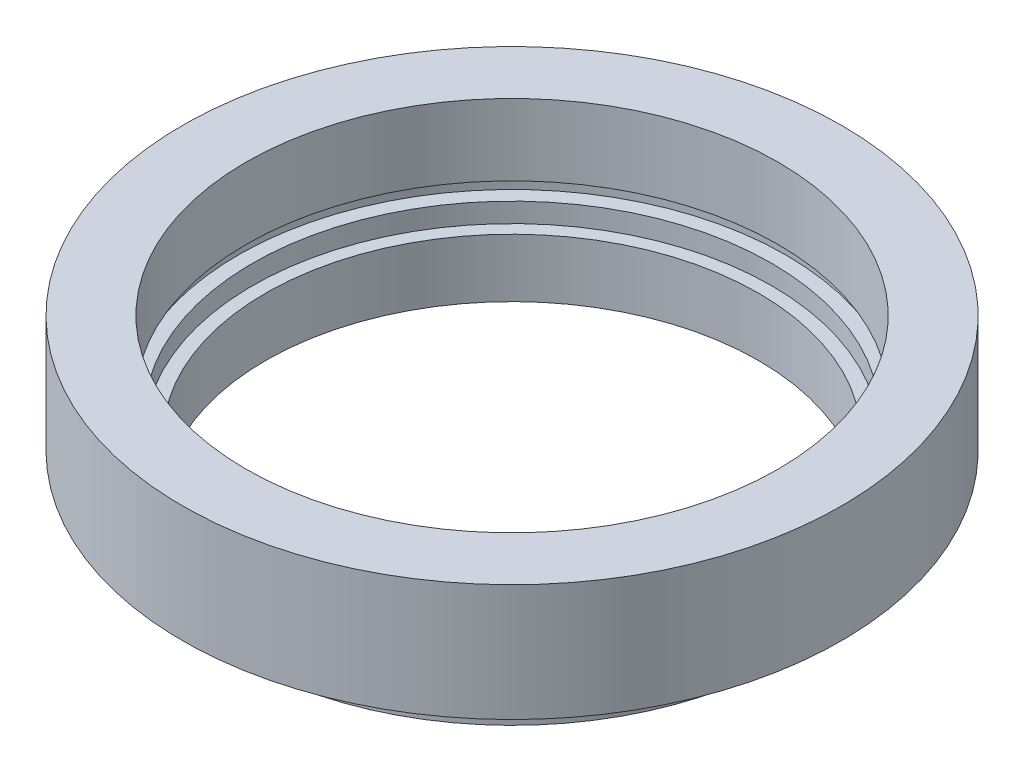
ISO-10303-21;
HEADER;
FILE_DESCRIPTION(('STEP AP214'),'2;1');
FILE_NAME('part.step','',(''),(''),'','','');
FILE_SCHEMA(('AUTOMOTIVE_DESIGN { 1 0 10303 214 1 1 1 1 }'));
ENDSEC;
DATA;
#1=APPLICATION_CONTEXT('core data for automotive mechanical design processes');
#2=APPLICATION_PROTOCOL_DEFINITION('international standard','automotive_design',2000,#1);
#3=PRODUCT_CONTEXT('',#1,'mechanical');
#4=PRODUCT('Part','Part','',(#3));
#5=PRODUCT_RELATED_PRODUCT_CATEGORY('part','',(#4));
#6=PRODUCT_DEFINITION_FORMATION('','',#4);
#7=PRODUCT_DEFINITION_CONTEXT('part definition',#1,'design');
#8=PRODUCT_DEFINITION('design','',#6,#7);
#9=PRODUCT_DEFINITION_SHAPE('','',#8);
#10=(LENGTH_UNIT() NAMED_UNIT(*) SI_UNIT(.MILLI.,.METRE.));
#11=(NAMED_UNIT(*) PLANE_ANGLE_UNIT() SI_UNIT($,.RADIAN.));
#12=(NAMED_UNIT(*) SI_UNIT($,.STERADIAN.) SOLID_ANGLE_UNIT());
#13=UNCERTAINTY_MEASURE_WITH_UNIT(LENGTH_MEASURE(1.E-05),#10,'distance_accuracy_value','');
#14=(GEOMETRIC_REPRESENTATION_CONTEXT(3) GLOBAL_UNCERTAINTY_ASSIGNED_CONTEXT((#13)) GLOBAL_UNIT_ASSIGNED_CONTEXT((#10,
#11,#12)) REPRESENTATION_CONTEXT('',''));
#15=CARTESIAN_POINT('',(0.,0.,0.));
#16=DIRECTION('',(0.,0.,1.));
#17=DIRECTION('',(1.,0.,0.));
#18=AXIS2_PLACEMENT_3D('',#15,#16,#17);
#19=CARTESIAN_POINT('',(0.,0.,0.));
#20=DIRECTION('',(0.,-1.,0.));
#21=DIRECTION('',(0.,0.,-1.));
#22=AXIS2_PLACEMENT_3D('',#19,#20,#21);
#23=CYLINDRICAL_SURFACE('',#22,19.);
#24=CARTESIAN_POINT('',(0.,0.,0.));
#25=DIRECTION('',(0.,-1.,0.));
#26=DIRECTION('',(0.,0.,-1.));
#27=AXIS2_PLACEMENT_3D('',#24,#25,#26);
#28=CIRCLE('',#27,19.);
#29=CARTESIAN_POINT('',(0.,0.,-19.));
#30=VERTEX_POINT('',#29);
#31=EDGE_CURVE('E10',#30,#30,#28,.T.);
#32=ORIENTED_EDGE('',*,*,#31,.T.);
#33=EDGE_LOOP('',(#32));
#34=FACE_BOUND('',#33,.T.);
#35=CARTESIAN_POINT('',(0.,4.5,0.));
#36=DIRECTION('',(0.,-1.,0.));
#37=DIRECTION('',(0.,0.,-1.));
#38=AXIS2_PLACEMENT_3D('',#35,#36,#37);
#39=CIRCLE('',#38,19.);
#40=CARTESIAN_POINT('',(0.,4.5,-19.));
#41=VERTEX_POINT('',#40);
#42=EDGE_CURVE('E95',#41,#41,#39,.T.);
#43=ORIENTED_EDGE('',*,*,#42,.F.);
#44=EDGE_LOOP('',(#43));
#45=FACE_BOUND('',#44,.T.);
#46=ADVANCED_FACE('F36',(#34,#45),#23,.F.);
#47=CARTESIAN_POINT('',(19.,0.,0.));
#48=DIRECTION('',(0.,-1.,0.));
#49=DIRECTION('',(0.,0.,-1.));
#50=AXIS2_PLACEMENT_3D('',#47,#48,#49);
#51=PLANE('',#50);
#52=CARTESIAN_POINT('',(0.,0.,0.));
#53=DIRECTION('',(0.,-1.,0.));
#54=DIRECTION('',(0.,0.,-1.));
#55=AXIS2_PLACEMENT_3D('',#52,#53,#54);
#56=CIRCLE('',#55,21.);
#57=CARTESIAN_POINT('',(0.,0.,-21.));
#58=VERTEX_POINT('',#57);
#59=EDGE_CURVE('E43',#58,#58,#56,.T.);
#60=ORIENTED_EDGE('',*,*,#59,.T.);
#61=EDGE_LOOP('',(#60));
#62=FACE_BOUND('',#61,.T.);
#63=ORIENTED_EDGE('',*,*,#31,.F.);
#64=EDGE_LOOP('',(#63));
#65=FACE_BOUND('',#64,.T.);
#66=ADVANCED_FACE('F104',(#62,#65),#51,.T.);
#67=CARTESIAN_POINT('',(0.,0.,0.));
#68=DIRECTION('',(0.,-1.,0.));
#69=DIRECTION('',(0.,0.,-1.));
#70=AXIS2_PLACEMENT_3D('',#67,#68,#69);
#71=CYLINDRICAL_SURFACE('',#70,21.);
#72=CARTESIAN_POINT('',(0.,2.5,0.));
#73=DIRECTION('',(0.,-1.,0.));
#74=DIRECTION('',(0.,0.,-1.));
#75=AXIS2_PLACEMENT_3D('',#72,#73,#74);
#76=CIRCLE('',#75,21.);
#77=CARTESIAN_POINT('',(0.,2.5,-21.));
#78=VERTEX_POINT('',#77);
#79=EDGE_CURVE('E50',#78,#78,#76,.T.);
#80=ORIENTED_EDGE('',*,*,#79,.T.);
#81=EDGE_LOOP('',(#80));
#82=FACE_BOUND('',#81,.T.);
#83=ORIENTED_EDGE('',*,*,#59,.F.);
#84=EDGE_LOOP('',(#83));
#85=FACE_BOUND('',#84,.T.);
#86=ADVANCED_FACE('F108',(#82,#85),#71,.T.);
#87=CARTESIAN_POINT('',(21.,2.5,0.));
#88=DIRECTION('',(0.,1.,0.));
#89=DIRECTION('',(0.,0.,1.));
#90=AXIS2_PLACEMENT_3D('',#87,#88,#89);
#91=PLANE('',#90);
#92=CARTESIAN_POINT('',(0.,2.5,0.));
#93=DIRECTION('',(0.,-1.,0.));
#94=DIRECTION('',(0.,0.,-1.));
#95=AXIS2_PLACEMENT_3D('',#92,#93,#94);
#96=CIRCLE('',#95,20.5);
#97=CARTESIAN_POINT('',(0.,2.5,-20.5));
#98=VERTEX_POINT('',#97);
#99=EDGE_CURVE('E56',#98,#98,#96,.T.);
#100=ORIENTED_EDGE('',*,*,#99,.T.);
#101=EDGE_LOOP('',(#100));
#102=FACE_BOUND('',#101,.T.);
#103=ORIENTED_EDGE('',*,*,#79,.F.);
#104=EDGE_LOOP('',(#103));
#105=FACE_BOUND('',#104,.T.);
#106=ADVANCED_FACE('F112',(#102,#105),#91,.T.);
#107=CARTESIAN_POINT('',(0.,0.,0.));
#108=DIRECTION('',(0.,-1.,0.));
#109=DIRECTION('',(0.,0.,-1.));
#110=AXIS2_PLACEMENT_3D('',#107,#108,#109);
#111=CYLINDRICAL_SURFACE('',#110,20.5);
#112=CARTESIAN_POINT('',(0.,3.5,0.));
#113=DIRECTION('',(0.,-1.,0.));
#114=DIRECTION('',(0.,0.,-1.));
#115=AXIS2_PLACEMENT_3D('',#112,#113,#114);
#116=CIRCLE('',#115,20.5);
#117=CARTESIAN_POINT('',(0.,3.5,-20.5));
#118=VERTEX_POINT('',#117);
#119=EDGE_CURVE('E62',#118,#118,#116,.T.);
#120=ORIENTED_EDGE('',*,*,#119,.T.);
#121=EDGE_LOOP('',(#120));
#122=FACE_BOUND('',#121,.T.);
#123=ORIENTED_EDGE('',*,*,#99,.F.);
#124=EDGE_LOOP('',(#123));
#125=FACE_BOUND('',#124,.T.);
#126=ADVANCED_FACE('F119',(#122,#125),#111,.T.);
#127=CARTESIAN_POINT('',(20.5,3.5,0.));
#128=DIRECTION('',(0.,-1.,0.));
#129=DIRECTION('',(0.,0.,-1.));
#130=AXIS2_PLACEMENT_3D('',#127,#128,#129);
#131=PLANE('',#130);
#132=CARTESIAN_POINT('',(0.,3.5,0.));
#133=DIRECTION('',(0.,-1.,0.));
#134=DIRECTION('',(0.,0.,-1.));
#135=AXIS2_PLACEMENT_3D('',#132,#133,#134);
#136=CIRCLE('',#135,25.4);
#137=CARTESIAN_POINT('',(0.,3.5,-25.4));
#138=VERTEX_POINT('',#137);
#139=EDGE_CURVE('E66',#138,#138,#136,.T.);
#140=ORIENTED_EDGE('',*,*,#139,.T.);
#141=EDGE_LOOP('',(#140));
#142=FACE_BOUND('',#141,.T.);
#143=ORIENTED_EDGE('',*,*,#119,.F.);
#144=EDGE_LOOP('',(#143));
#145=FACE_BOUND('',#144,.T.);
#146=ADVANCED_FACE('F123',(#142,#145),#131,.T.);
#147=CARTESIAN_POINT('',(0.,0.,0.));
#148=DIRECTION('',(0.,-1.,0.));
#149=DIRECTION('',(0.,0.,-1.));
#150=AXIS2_PLACEMENT_3D('',#147,#148,#149);
#151=CYLINDRICAL_SURFACE('',#150,25.4);
#152=CARTESIAN_POINT('',(0.,12.5,0.));
#153=DIRECTION('',(0.,-1.,0.));
#154=DIRECTION('',(0.,0.,-1.));
#155=AXIS2_PLACEMENT_3D('',#152,#153,#154);
#156=CIRCLE('',#155,25.4);
#157=CARTESIAN_POINT('',(0.,12.5,-25.4));
#158=VERTEX_POINT('',#157);
#159=EDGE_CURVE('E70',#158,#158,#156,.T.);
#160=ORIENTED_EDGE('',*,*,#159,.T.);
#161=EDGE_LOOP('',(#160));
#162=FACE_BOUND('',#161,.T.);
#163=ORIENTED_EDGE('',*,*,#139,.F.);
#164=EDGE_LOOP('',(#163));
#165=FACE_BOUND('',#164,.T.);
#166=ADVANCED_FACE('F127',(#162,#165),#151,.T.);
#167=CARTESIAN_POINT('',(25.4,12.5,0.));
#168=DIRECTION('',(0.,1.,0.));
#169=DIRECTION('',(0.,0.,1.));
#170=AXIS2_PLACEMENT_3D('',#167,#168,#169);
#171=PLANE('',#170);
#172=CARTESIAN_POINT('',(0.,12.5,0.));
#173=DIRECTION('',(0.,-1.,0.));
#174=DIRECTION('',(0.,0.,-1.));
#175=AXIS2_PLACEMENT_3D('',#172,#173,#174);
#176=CIRCLE('',#175,20.5);
#177=CARTESIAN_POINT('',(0.,12.5,-20.5));
#178=VERTEX_POINT('',#177);
#179=EDGE_CURVE('E73',#178,#178,#176,.T.);
#180=ORIENTED_EDGE('',*,*,#179,.T.);
#181=EDGE_LOOP('',(#180));
#182=FACE_BOUND('',#181,.T.);
#183=ORIENTED_EDGE('',*,*,#159,.F.);
#184=EDGE_LOOP('',(#183));
#185=FACE_BOUND('',#184,.T.);
#186=ADVANCED_FACE('F131',(#182,#185),#171,.T.);
#187=CARTESIAN_POINT('',(0.,0.,0.));
#188=DIRECTION('',(0.,-1.,0.));
#189=DIRECTION('',(0.,0.,-1.));
#190=AXIS2_PLACEMENT_3D('',#187,#188,#189);
#191=CYLINDRICAL_SURFACE('',#190,20.5);
#192=CARTESIAN_POINT('',(0.,7.,0.));
#193=DIRECTION('',(0.,-1.,0.));
#194=DIRECTION('',(0.,0.,-1.));
#195=AXIS2_PLACEMENT_3D('',#192,#193,#194);
#196=CIRCLE('',#195,20.5);
#197=CARTESIAN_POINT('',(0.,7.,-20.5));
#198=VERTEX_POINT('',#197);
#199=EDGE_CURVE('E77',#198,#198,#196,.T.);
#200=ORIENTED_EDGE('',*,*,#199,.T.);
#201=EDGE_LOOP('',(#200));
#202=FACE_BOUND('',#201,.T.);
#203=ORIENTED_EDGE('',*,*,#179,.F.);
#204=EDGE_LOOP('',(#203));
#205=FACE_BOUND('',#204,.T.);
#206=ADVANCED_FACE('F135',(#202,#205),#191,.F.);
#207=CARTESIAN_POINT('',(20.5,7.,0.));
#208=DIRECTION('',(0.,-1.,0.));
#209=DIRECTION('',(0.,0.,-1.));
#210=AXIS2_PLACEMENT_3D('',#207,#208,#209);
#211=PLANE('',#210);
#212=CARTESIAN_POINT('',(0.,7.,0.));
#213=DIRECTION('',(0.,-1.,0.));
#214=DIRECTION('',(0.,0.,-1.));
#215=AXIS2_PLACEMENT_3D('',#212,#213,#214);
#216=CIRCLE('',#215,21.1);
#217=CARTESIAN_POINT('',(0.,7.,-21.1));
#218=VERTEX_POINT('',#217);
#219=EDGE_CURVE('E81',#218,#218,#216,.T.);
#220=ORIENTED_EDGE('',*,*,#219,.T.);
#221=EDGE_LOOP('',(#220));
#222=FACE_BOUND('',#221,.T.);
#223=ORIENTED_EDGE('',*,*,#199,.F.);
#224=EDGE_LOOP('',(#223));
#225=FACE_BOUND('',#224,.T.);
#226=ADVANCED_FACE('F139',(#222,#225),#211,.T.);
#227=CARTESIAN_POINT('',(0.,0.,0.));
#228=DIRECTION('',(0.,-1.,0.));
#229=DIRECTION('',(0.,0.,-1.));
#230=AXIS2_PLACEMENT_3D('',#227,#228,#229);
#231=CYLINDRICAL_SURFACE('',#230,21.1);
#232=CARTESIAN_POINT('',(0.,6.,0.));
#233=DIRECTION('',(0.,-1.,0.));
#234=DIRECTION('',(0.,0.,-1.));
#235=AXIS2_PLACEMENT_3D('',#232,#233,#234);
#236=CIRCLE('',#235,21.1);
#237=CARTESIAN_POINT('',(0.,6.,-21.1));
#238=VERTEX_POINT('',#237);
#239=EDGE_CURVE('E85',#238,#238,#236,.T.);
#240=ORIENTED_EDGE('',*,*,#239,.T.);
#241=EDGE_LOOP('',(#240));
#242=FACE_BOUND('',#241,.T.);
#243=ORIENTED_EDGE('',*,*,#219,.F.);
#244=EDGE_LOOP('',(#243));
#245=FACE_BOUND('',#244,.T.);
#246=ADVANCED_FACE('F143',(#242,#245),#231,.F.);
#247=CARTESIAN_POINT('',(21.1,6.,0.));
#248=DIRECTION('',(0.,1.,0.));
#249=DIRECTION('',(0.,0.,1.));
#250=AXIS2_PLACEMENT_3D('',#247,#248,#249);
#251=PLANE('',#250);
#252=CARTESIAN_POINT('',(0.,6.,0.));
#253=DIRECTION('',(0.,-1.,0.));
#254=DIRECTION('',(0.,0.,-1.));
#255=AXIS2_PLACEMENT_3D('',#252,#253,#254);
#256=CIRCLE('',#255,20.);
#257=CARTESIAN_POINT('',(0.,6.,-20.));
#258=VERTEX_POINT('',#257);
#259=EDGE_CURVE('E88',#258,#258,#256,.T.);
#260=ORIENTED_EDGE('',*,*,#259,.T.);
#261=EDGE_LOOP('',(#260));
#262=FACE_BOUND('',#261,.T.);
#263=ORIENTED_EDGE('',*,*,#239,.F.);
#264=EDGE_LOOP('',(#263));
#265=FACE_BOUND('',#264,.T.);
#266=ADVANCED_FACE('F147',(#262,#265),#251,.T.);
#267=CARTESIAN_POINT('',(0.,0.,0.));
#268=DIRECTION('',(0.,-1.,0.));
#269=DIRECTION('',(0.,0.,-1.));
#270=AXIS2_PLACEMENT_3D('',#267,#268,#269);
#271=CYLINDRICAL_SURFACE('',#270,20.);
#272=CARTESIAN_POINT('',(0.,4.5,0.));
#273=DIRECTION('',(0.,-1.,0.));
#274=DIRECTION('',(0.,0.,-1.));
#275=AXIS2_PLACEMENT_3D('',#272,#273,#274);
#276=CIRCLE('',#275,20.);
#277=CARTESIAN_POINT('',(0.,4.5,-20.));
#278=VERTEX_POINT('',#277);
#279=EDGE_CURVE('E91',#278,#278,#276,.T.);
#280=ORIENTED_EDGE('',*,*,#279,.T.);
#281=EDGE_LOOP('',(#280));
#282=FACE_BOUND('',#281,.T.);
#283=ORIENTED_EDGE('',*,*,#259,.F.);
#284=EDGE_LOOP('',(#283));
#285=FACE_BOUND('',#284,.T.);
#286=ADVANCED_FACE('F151',(#282,#285),#271,.F.);
#287=CARTESIAN_POINT('',(20.,4.5,0.));
#288=DIRECTION('',(0.,1.,0.));
#289=DIRECTION('',(0.,0.,1.));
#290=AXIS2_PLACEMENT_3D('',#287,#288,#289);
#291=PLANE('',#290);
#292=ORIENTED_EDGE('',*,*,#42,.T.);
#293=EDGE_LOOP('',(#292));
#294=FACE_BOUND('',#293,.T.);
#295=ORIENTED_EDGE('',*,*,#279,.F.);
#296=EDGE_LOOP('',(#295));
#297=FACE_BOUND('',#296,.T.);
#298=ADVANCED_FACE('F100',(#294,#297),#291,.T.);
#299=CLOSED_SHELL('',(#46,#66,#86,#106,#126,#146,#166,#186,#206,#226,#246,#266,#286,#298));
#300=MANIFOLD_SOLID_BREP('B2',#299);
#301=ADVANCED_BREP_SHAPE_REPRESENTATION('',(#18,#300),#14);
#302=SHAPE_DEFINITION_REPRESENTATION(#9,#301);
ENDSEC;
END-ISO-10303-21;
